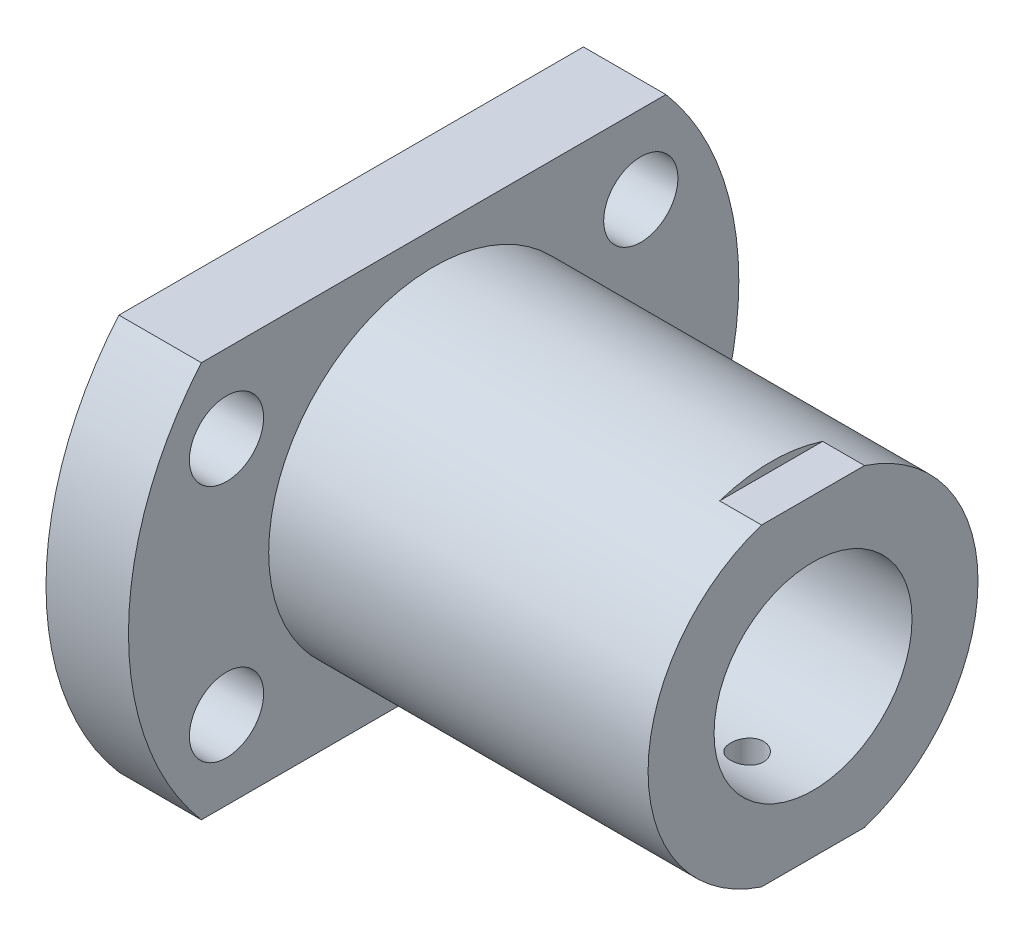
ISO-10303-21;
HEADER;
FILE_DESCRIPTION(('STEP AP214'),'2;1');
FILE_NAME('part.step','',(''),(''),'','','');
FILE_SCHEMA(('AUTOMOTIVE_DESIGN { 1 0 10303 214 1 1 1 1 }'));
ENDSEC;
DATA;
#1=APPLICATION_CONTEXT('core data for automotive mechanical design processes');
#2=APPLICATION_PROTOCOL_DEFINITION('international standard','automotive_design',2000,#1);
#3=PRODUCT_CONTEXT('',#1,'mechanical');
#4=PRODUCT('Part','Part','',(#3));
#5=PRODUCT_RELATED_PRODUCT_CATEGORY('part','',(#4));
#6=PRODUCT_DEFINITION_FORMATION('','',#4);
#7=PRODUCT_DEFINITION_CONTEXT('part definition',#1,'design');
#8=PRODUCT_DEFINITION('design','',#6,#7);
#9=PRODUCT_DEFINITION_SHAPE('','',#8);
#10=(LENGTH_UNIT() NAMED_UNIT(*) SI_UNIT(.MILLI.,.METRE.));
#11=(NAMED_UNIT(*) PLANE_ANGLE_UNIT() SI_UNIT($,.RADIAN.));
#12=(NAMED_UNIT(*) SI_UNIT($,.STERADIAN.) SOLID_ANGLE_UNIT());
#13=UNCERTAINTY_MEASURE_WITH_UNIT(LENGTH_MEASURE(1.E-05),#10,'distance_accuracy_value','');
#14=(GEOMETRIC_REPRESENTATION_CONTEXT(3) GLOBAL_UNCERTAINTY_ASSIGNED_CONTEXT((#13)) GLOBAL_UNIT_ASSIGNED_CONTEXT((#10,
#11,#12)) REPRESENTATION_CONTEXT('',''));
#15=CARTESIAN_POINT('',(0.,0.,0.));
#16=DIRECTION('',(0.,0.,1.));
#17=DIRECTION('',(1.,0.,0.));
#18=AXIS2_PLACEMENT_3D('',#15,#16,#17);
#19=CARTESIAN_POINT('',(0.,0.,0.));
#20=DIRECTION('',(1.,0.,0.));
#21=DIRECTION('',(0.,0.,-1.));
#22=AXIS2_PLACEMENT_3D('',#19,#20,#21);
#23=PLANE('',#22);
#24=DIRECTION('',(0.,0.,-1.));
#25=VECTOR('',#24,1.);
#26=CARTESIAN_POINT('',(0.,-12.,-14.0801278403287));
#27=LINE('',#26,#25);
#28=CARTESIAN_POINT('',(0.,-12.,14.0801278403287));
#29=VERTEX_POINT('',#28);
#30=CARTESIAN_POINT('',(0.,-12.,-14.0801278403287));
#31=VERTEX_POINT('',#30);
#32=EDGE_CURVE('E90',#29,#31,#27,.T.);
#33=ORIENTED_EDGE('',*,*,#32,.F.);
#34=CARTESIAN_POINT('',(0.,0.,0.));
#35=DIRECTION('',(-1.,0.,0.));
#36=DIRECTION('',(0.,0.,1.));
#37=AXIS2_PLACEMENT_3D('',#34,#35,#36);
#38=CIRCLE('',#37,18.5);
#39=CARTESIAN_POINT('',(0.,12.,14.0801278403287));
#40=VERTEX_POINT('',#39);
#41=EDGE_CURVE('E77',#40,#29,#38,.F.);
#42=ORIENTED_EDGE('',*,*,#41,.F.);
#43=DIRECTION('',(0.,0.,1.));
#44=VECTOR('',#43,1.);
#45=CARTESIAN_POINT('',(0.,12.,-14.0801278403287));
#46=LINE('',#45,#44);
#47=CARTESIAN_POINT('',(0.,12.,-14.0801278403287));
#48=VERTEX_POINT('',#47);
#49=EDGE_CURVE('E87',#48,#40,#46,.T.);
#50=ORIENTED_EDGE('',*,*,#49,.F.);
#51=CARTESIAN_POINT('',(0.,0.,0.));
#52=DIRECTION('',(-1.,0.,0.));
#53=DIRECTION('',(0.,0.,1.));
#54=AXIS2_PLACEMENT_3D('',#51,#52,#53);
#55=CIRCLE('',#54,18.5);
#56=EDGE_CURVE('E93',#31,#48,#55,.F.);
#57=ORIENTED_EDGE('',*,*,#56,.F.);
#58=EDGE_LOOP('',(#33,#42,#50,#57));
#59=FACE_BOUND('',#58,.T.);
#60=CARTESIAN_POINT('',(0.,0.,0.));
#61=DIRECTION('',(-1.,0.,0.));
#62=DIRECTION('',(0.,0.,1.));
#63=AXIS2_PLACEMENT_3D('',#60,#61,#62);
#64=CIRCLE('',#63,6.);
#65=CARTESIAN_POINT('',(0.,0.,6.));
#66=VERTEX_POINT('',#65);
#67=EDGE_CURVE('E169',#66,#66,#64,.F.);
#68=ORIENTED_EDGE('',*,*,#67,.T.);
#69=EDGE_LOOP('',(#68));
#70=FACE_BOUND('',#69,.T.);
#71=CARTESIAN_POINT('',(0.,7.25000000000001,-12.5573683548744));
#72=DIRECTION('',(-1.,0.,0.));
#73=DIRECTION('',(0.,0.,1.));
#74=AXIS2_PLACEMENT_3D('',#71,#72,#73);
#75=CIRCLE('',#74,2.25);
#76=CARTESIAN_POINT('',(0.,7.25000000000001,-10.3073683548744));
#77=VERTEX_POINT('',#76);
#78=EDGE_CURVE('E96',#77,#77,#75,.F.);
#79=ORIENTED_EDGE('',*,*,#78,.T.);
#80=EDGE_LOOP('',(#79));
#81=FACE_BOUND('',#80,.T.);
#82=CARTESIAN_POINT('',(0.,-7.25000000000002,-12.5573683548743));
#83=DIRECTION('',(-1.,0.,0.));
#84=DIRECTION('',(0.,0.,1.));
#85=AXIS2_PLACEMENT_3D('',#82,#83,#84);
#86=CIRCLE('',#85,2.25);
#87=CARTESIAN_POINT('',(0.,-7.25000000000002,-10.3073683548743));
#88=VERTEX_POINT('',#87);
#89=EDGE_CURVE('E176',#88,#88,#86,.F.);
#90=ORIENTED_EDGE('',*,*,#89,.T.);
#91=EDGE_LOOP('',(#90));
#92=FACE_BOUND('',#91,.T.);
#93=CARTESIAN_POINT('',(0.,-7.25000000000002,12.5573683548743));
#94=DIRECTION('',(-1.,0.,0.));
#95=DIRECTION('',(0.,0.,1.));
#96=AXIS2_PLACEMENT_3D('',#93,#94,#95);
#97=CIRCLE('',#96,2.25);
#98=CARTESIAN_POINT('',(0.,-7.25000000000002,14.8073683548744));
#99=VERTEX_POINT('',#98);
#100=EDGE_CURVE('E178',#99,#99,#97,.F.);
#101=ORIENTED_EDGE('',*,*,#100,.T.);
#102=EDGE_LOOP('',(#101));
#103=FACE_BOUND('',#102,.T.);
#104=CARTESIAN_POINT('',(0.,7.25000000000002,12.5573683548743));
#105=DIRECTION('',(-1.,0.,0.));
#106=DIRECTION('',(0.,0.,1.));
#107=AXIS2_PLACEMENT_3D('',#104,#105,#106);
#108=CIRCLE('',#107,2.25);
#109=CARTESIAN_POINT('',(0.,7.25000000000002,14.8073683548743));
#110=VERTEX_POINT('',#109);
#111=EDGE_CURVE('E19',#110,#110,#108,.F.);
#112=ORIENTED_EDGE('',*,*,#111,.T.);
#113=EDGE_LOOP('',(#112));
#114=FACE_BOUND('',#113,.T.);
#115=ADVANCED_FACE('F16',(#59,#70,#81,#92,#103,#114),#23,.F.);
#116=CARTESIAN_POINT('',(28.,7.25000000000002,12.5573683548743));
#117=DIRECTION('',(-1.,0.,0.));
#118=DIRECTION('',(0.,0.,1.));
#119=AXIS2_PLACEMENT_3D('',#116,#117,#118);
#120=CYLINDRICAL_SURFACE('',#119,2.25);
#121=CARTESIAN_POINT('',(5.,7.25000000000002,12.5573683548743));
#122=DIRECTION('',(-1.,0.,0.));
#123=DIRECTION('',(0.,0.,1.));
#124=AXIS2_PLACEMENT_3D('',#121,#122,#123);
#125=CIRCLE('',#124,2.25);
#126=CARTESIAN_POINT('',(5.,7.25000000000002,14.8073683548743));
#127=VERTEX_POINT('',#126);
#128=EDGE_CURVE('E384',#127,#127,#125,.F.);
#129=ORIENTED_EDGE('',*,*,#128,.T.);
#130=EDGE_LOOP('',(#129));
#131=FACE_BOUND('',#130,.T.);
#132=ORIENTED_EDGE('',*,*,#111,.F.);
#133=EDGE_LOOP('',(#132));
#134=FACE_BOUND('',#133,.T.);
#135=ADVANCED_FACE('F186',(#131,#134),#120,.F.);
#136=CARTESIAN_POINT('',(28.,-7.25000000000002,12.5573683548743));
#137=DIRECTION('',(-1.,0.,0.));
#138=DIRECTION('',(0.,0.,1.));
#139=AXIS2_PLACEMENT_3D('',#136,#137,#138);
#140=CYLINDRICAL_SURFACE('',#139,2.25);
#141=CARTESIAN_POINT('',(5.,-7.25000000000002,12.5573683548743));
#142=DIRECTION('',(-1.,0.,0.));
#143=DIRECTION('',(0.,0.,1.));
#144=AXIS2_PLACEMENT_3D('',#141,#142,#143);
#145=CIRCLE('',#144,2.25);
#146=CARTESIAN_POINT('',(5.,-7.25000000000002,14.8073683548744));
#147=VERTEX_POINT('',#146);
#148=EDGE_CURVE('E380',#147,#147,#145,.F.);
#149=ORIENTED_EDGE('',*,*,#148,.T.);
#150=EDGE_LOOP('',(#149));
#151=FACE_BOUND('',#150,.T.);
#152=ORIENTED_EDGE('',*,*,#100,.F.);
#153=EDGE_LOOP('',(#152));
#154=FACE_BOUND('',#153,.T.);
#155=ADVANCED_FACE('F188',(#151,#154),#140,.F.);
#156=CARTESIAN_POINT('',(28.,-7.25000000000002,-12.5573683548743));
#157=DIRECTION('',(-1.,0.,0.));
#158=DIRECTION('',(0.,0.,1.));
#159=AXIS2_PLACEMENT_3D('',#156,#157,#158);
#160=CYLINDRICAL_SURFACE('',#159,2.25);
#161=CARTESIAN_POINT('',(5.,-7.25000000000002,-12.5573683548743));
#162=DIRECTION('',(-1.,0.,0.));
#163=DIRECTION('',(0.,0.,1.));
#164=AXIS2_PLACEMENT_3D('',#161,#162,#163);
#165=CIRCLE('',#164,2.25);
#166=CARTESIAN_POINT('',(5.,-7.25000000000002,-10.3073683548743));
#167=VERTEX_POINT('',#166);
#168=EDGE_CURVE('E255',#167,#167,#165,.F.);
#169=ORIENTED_EDGE('',*,*,#168,.T.);
#170=EDGE_LOOP('',(#169));
#171=FACE_BOUND('',#170,.T.);
#172=ORIENTED_EDGE('',*,*,#89,.F.);
#173=EDGE_LOOP('',(#172));
#174=FACE_BOUND('',#173,.T.);
#175=ADVANCED_FACE('F195',(#171,#174),#160,.F.);
#176=CARTESIAN_POINT('',(28.,7.25000000000001,-12.5573683548744));
#177=DIRECTION('',(-1.,0.,0.));
#178=DIRECTION('',(0.,0.,1.));
#179=AXIS2_PLACEMENT_3D('',#176,#177,#178);
#180=CYLINDRICAL_SURFACE('',#179,2.25);
#181=CARTESIAN_POINT('',(5.,7.25000000000001,-12.5573683548744));
#182=DIRECTION('',(-1.,0.,0.));
#183=DIRECTION('',(0.,0.,1.));
#184=AXIS2_PLACEMENT_3D('',#181,#182,#183);
#185=CIRCLE('',#184,2.25);
#186=CARTESIAN_POINT('',(5.,7.25000000000001,-10.3073683548744));
#187=VERTEX_POINT('',#186);
#188=EDGE_CURVE('E252',#187,#187,#185,.F.);
#189=ORIENTED_EDGE('',*,*,#188,.T.);
#190=EDGE_LOOP('',(#189));
#191=FACE_BOUND('',#190,.T.);
#192=ORIENTED_EDGE('',*,*,#78,.F.);
#193=EDGE_LOOP('',(#192));
#194=FACE_BOUND('',#193,.T.);
#195=ADVANCED_FACE('F202',(#191,#194),#180,.F.);
#196=CARTESIAN_POINT('',(5.,-12.,-14.0801278403287));
#197=DIRECTION('',(0.,-1.,0.));
#198=DIRECTION('',(0.,0.,-1.));
#199=AXIS2_PLACEMENT_3D('',#196,#197,#198);
#200=PLANE('',#199);
#201=DIRECTION('',(0.,0.,1.));
#202=VECTOR('',#201,1.);
#203=CARTESIAN_POINT('',(5.,-12.,0.));
#204=LINE('',#203,#202);
#205=CARTESIAN_POINT('',(5.,-12.,-14.0801278403287));
#206=VERTEX_POINT('',#205);
#207=CARTESIAN_POINT('',(5.,-12.,14.0801278403287));
#208=VERTEX_POINT('',#207);
#209=EDGE_CURVE('E101',#206,#208,#204,.T.);
#210=ORIENTED_EDGE('',*,*,#209,.T.);
#211=DIRECTION('',(-1.,0.,0.));
#212=VECTOR('',#211,1.);
#213=CARTESIAN_POINT('',(5.,-12.,14.0801278403287));
#214=LINE('',#213,#212);
#215=EDGE_CURVE('E83',#29,#208,#214,.F.);
#216=ORIENTED_EDGE('',*,*,#215,.F.);
#217=ORIENTED_EDGE('',*,*,#32,.T.);
#218=DIRECTION('',(-1.,0.,0.));
#219=VECTOR('',#218,1.);
#220=CARTESIAN_POINT('',(5.,-12.,-14.0801278403287));
#221=LINE('',#220,#219);
#222=EDGE_CURVE('E245',#206,#31,#221,.T.);
#223=ORIENTED_EDGE('',*,*,#222,.F.);
#224=EDGE_LOOP('',(#210,#216,#217,#223));
#225=FACE_BOUND('',#224,.T.);
#226=ADVANCED_FACE('F99',(#225),#200,.T.);
#227=CARTESIAN_POINT('',(5.,0.,0.));
#228=DIRECTION('',(-1.,0.,0.));
#229=DIRECTION('',(0.,0.,1.));
#230=AXIS2_PLACEMENT_3D('',#227,#228,#229);
#231=CYLINDRICAL_SURFACE('',#230,18.5);
#232=DIRECTION('',(1.,0.,0.));
#233=VECTOR('',#232,1.);
#234=CARTESIAN_POINT('',(5.,12.,14.0801278403287));
#235=LINE('',#234,#233);
#236=CARTESIAN_POINT('',(5.,12.,14.0801278403287));
#237=VERTEX_POINT('',#236);
#238=EDGE_CURVE('E85',#40,#237,#235,.T.);
#239=ORIENTED_EDGE('',*,*,#238,.F.);
#240=ORIENTED_EDGE('',*,*,#41,.T.);
#241=ORIENTED_EDGE('',*,*,#215,.T.);
#242=CARTESIAN_POINT('',(5.,0.,0.));
#243=DIRECTION('',(-1.,0.,0.));
#244=DIRECTION('',(0.,0.,1.));
#245=AXIS2_PLACEMENT_3D('',#242,#243,#244);
#246=CIRCLE('',#245,18.5);
#247=EDGE_CURVE('E251',#208,#237,#246,.T.);
#248=ORIENTED_EDGE('',*,*,#247,.T.);
#249=EDGE_LOOP('',(#239,#240,#241,#248));
#250=FACE_BOUND('',#249,.T.);
#251=ADVANCED_FACE('F81',(#250),#231,.T.);
#252=CARTESIAN_POINT('',(5.,12.,-14.0801278403287));
#253=DIRECTION('',(0.,1.,0.));
#254=DIRECTION('',(0.,0.,1.));
#255=AXIS2_PLACEMENT_3D('',#252,#253,#254);
#256=PLANE('',#255);
#257=DIRECTION('',(0.,0.,1.));
#258=VECTOR('',#257,1.);
#259=CARTESIAN_POINT('',(5.,12.,0.));
#260=LINE('',#259,#258);
#261=CARTESIAN_POINT('',(5.,12.,-14.0801278403287));
#262=VERTEX_POINT('',#261);
#263=EDGE_CURVE('E240',#237,#262,#260,.F.);
#264=ORIENTED_EDGE('',*,*,#263,.T.);
#265=DIRECTION('',(-1.,0.,0.));
#266=VECTOR('',#265,1.);
#267=CARTESIAN_POINT('',(5.,12.,-14.0801278403287));
#268=LINE('',#267,#266);
#269=EDGE_CURVE('E172',#48,#262,#268,.F.);
#270=ORIENTED_EDGE('',*,*,#269,.F.);
#271=ORIENTED_EDGE('',*,*,#49,.T.);
#272=ORIENTED_EDGE('',*,*,#238,.T.);
#273=EDGE_LOOP('',(#264,#270,#271,#272));
#274=FACE_BOUND('',#273,.T.);
#275=ADVANCED_FACE('F211',(#274),#256,.T.);
#276=CARTESIAN_POINT('',(5.,0.,0.));
#277=DIRECTION('',(-1.,0.,0.));
#278=DIRECTION('',(0.,0.,1.));
#279=AXIS2_PLACEMENT_3D('',#276,#277,#278);
#280=CYLINDRICAL_SURFACE('',#279,18.5);
#281=CARTESIAN_POINT('',(5.,0.,0.));
#282=DIRECTION('',(-1.,0.,0.));
#283=DIRECTION('',(0.,0.,1.));
#284=AXIS2_PLACEMENT_3D('',#281,#282,#283);
#285=CIRCLE('',#284,18.5);
#286=EDGE_CURVE('E237',#262,#206,#285,.T.);
#287=ORIENTED_EDGE('',*,*,#286,.T.);
#288=ORIENTED_EDGE('',*,*,#222,.T.);
#289=ORIENTED_EDGE('',*,*,#56,.T.);
#290=ORIENTED_EDGE('',*,*,#269,.T.);
#291=EDGE_LOOP('',(#287,#288,#289,#290));
#292=FACE_BOUND('',#291,.T.);
#293=ADVANCED_FACE('F214',(#292),#280,.T.);
#294=CARTESIAN_POINT('',(25.46,-9.5,-18.5));
#295=DIRECTION('',(-1.,0.,0.));
#296=DIRECTION('',(0.,-1.,0.));
#297=AXIS2_PLACEMENT_3D('',#294,#295,#296);
#298=PLANE('',#297);
#299=CARTESIAN_POINT('',(25.46,0.,0.));
#300=DIRECTION('',(-1.,0.,0.));
#301=DIRECTION('',(0.,0.,1.));
#302=AXIS2_PLACEMENT_3D('',#299,#300,#301);
#303=CIRCLE('',#302,10.);
#304=CARTESIAN_POINT('',(25.46,-9.5,-3.12249899919921));
#305=VERTEX_POINT('',#304);
#306=CARTESIAN_POINT('',(25.46,-9.5,3.1224989991992));
#307=VERTEX_POINT('',#306);
#308=EDGE_CURVE('E131',#305,#307,#303,.T.);
#309=ORIENTED_EDGE('',*,*,#308,.F.);
#310=DIRECTION('',(0.,0.,1.));
#311=VECTOR('',#310,1.);
#312=CARTESIAN_POINT('',(25.46,-9.5,-18.5));
#313=LINE('',#312,#311);
#314=EDGE_CURVE('E170',#305,#307,#313,.T.);
#315=ORIENTED_EDGE('',*,*,#314,.T.);
#316=EDGE_LOOP('',(#309,#315));
#317=FACE_BOUND('',#316,.T.);
#318=ADVANCED_FACE('F217',(#317),#298,.F.);
#319=CARTESIAN_POINT('',(24.,-12.,0.));
#320=DIRECTION('',(0.,1.,0.));
#321=DIRECTION('',(0.,0.,1.));
#322=AXIS2_PLACEMENT_3D('',#319,#320,#321);
#323=CYLINDRICAL_SURFACE('',#322,0.999999999999998);
#324=CARTESIAN_POINT('',(24.,-5.91607978309962,0.999999999999998));
#325=CARTESIAN_POINT('',(24.0556957397448,-5.91608089760083,0.999997430362736));
#326=CARTESIAN_POINT('',(24.111462585772,-5.91687549623227,0.995327225125144));
#327=CARTESIAN_POINT('',(24.2214733672251,-5.91996725428782,0.976766506224319));
#328=CARTESIAN_POINT('',(24.2757139738488,-5.92226746704964,0.962857255219504));
#329=CARTESIAN_POINT('',(24.3810020750206,-5.92810282103682,0.926249422813517));
#330=CARTESIAN_POINT('',(24.4320535063324,-5.93163640278117,0.903561936766004));
#331=CARTESIAN_POINT('',(24.5296048620222,-5.9395382156152,0.850066639095232));
#332=CARTESIAN_POINT('',(24.5761064650155,-5.94390613711394,0.819261837886824));
#333=CARTESIAN_POINT('',(24.663723871425,-5.95303376602086,0.750075912978846));
#334=CARTESIAN_POINT('',(24.7047878920607,-5.95779662271406,0.711629612614948));
#335=CARTESIAN_POINT('',(24.7799155928021,-5.9671496849089,0.628391119356938));
#336=CARTESIAN_POINT('',(24.8139784963782,-5.9717398712127,0.583598223459331));
#337=CARTESIAN_POINT('',(24.8743259504081,-5.98026296666789,0.488608939901646));
#338=CARTESIAN_POINT('',(24.9005630285583,-5.98419180380442,0.438381996059988));
#339=CARTESIAN_POINT('',(24.9442085816065,-5.99091497211554,0.334157780528416));
#340=CARTESIAN_POINT('',(24.9616177068692,-5.99370938686122,0.280160786915633));
#341=CARTESIAN_POINT('',(24.9869570028593,-5.99782693717048,0.170457536268949));
#342=CARTESIAN_POINT('',(24.9949731532148,-5.99916341023759,0.114771647626945));
#343=CARTESIAN_POINT('',(25.0015663038603,-6.00026031774893,0.00283020778882272));
#344=CARTESIAN_POINT('',(25.000143930067,-6.00002085670142,-0.0534253053855523));
#345=CARTESIAN_POINT('',(24.9879674852323,-5.99800343784229,-0.164320648453425));
#346=CARTESIAN_POINT('',(24.9773060259492,-5.99624074921798,-0.218970964751015));
#347=CARTESIAN_POINT('',(24.9470997266195,-5.99139194038926,-0.325696364455005));
#348=CARTESIAN_POINT('',(24.9275545434525,-5.98830576906758,-0.377771348306927));
#349=CARTESIAN_POINT('',(24.8800428392956,-5.98113065499251,-0.478144400660145));
#350=CARTESIAN_POINT('',(24.8520378864421,-5.97703715210988,-0.526423938030248));
#351=CARTESIAN_POINT('',(24.7884320570964,-5.96830259348044,-0.617629541642158));
#352=CARTESIAN_POINT('',(24.7528311514854,-5.96366153563462,-0.660555587360561));
#353=CARTESIAN_POINT('',(24.6745373682105,-5.95428211061504,-0.740379653882565));
#354=CARTESIAN_POINT('',(24.6317648343995,-5.9495432433298,-0.777199520036934));
#355=CARTESIAN_POINT('',(24.5405857257885,-5.9405537217856,-0.84316900713159));
#356=CARTESIAN_POINT('',(24.4921766297695,-5.93630328770353,-0.872315176491827));
#357=CARTESIAN_POINT('',(24.3909947392696,-5.92877116046283,-0.922122995219524));
#358=CARTESIAN_POINT('',(24.3382137479271,-5.92549134225201,-0.942768253004033));
#359=CARTESIAN_POINT('',(24.2299355600204,-5.92030089070035,-0.974836086298936));
#360=CARTESIAN_POINT('',(24.1744443666015,-5.91838736593836,-0.986278144632044));
#361=CARTESIAN_POINT('',(24.0987926780435,-5.91687159118963,-0.99530574898543));
#362=CARTESIAN_POINT('',(24.0790789007515,-5.91657531838753,-0.99706467292526));
#363=CARTESIAN_POINT('',(24.0395797428412,-5.91617921619692,-0.999412255641839));
#364=CARTESIAN_POINT('',(24.0197943621517,-5.91607938700397,-1.00000091325352));
#365=CARTESIAN_POINT('',(23.9443042602552,-5.91608089760085,-0.999997430362737));
#366=CARTESIAN_POINT('',(23.888537414228,-5.91687549623227,-0.995327225125145));
#367=CARTESIAN_POINT('',(23.7785266327749,-5.91996725428781,-0.976766506224319));
#368=CARTESIAN_POINT('',(23.7242860261512,-5.92226746704963,-0.962857255219503));
#369=CARTESIAN_POINT('',(23.6189979249794,-5.92810282103682,-0.926249422813517));
#370=CARTESIAN_POINT('',(23.5679464936676,-5.93163640278117,-0.903561936766004));
#371=CARTESIAN_POINT('',(23.4703951379778,-5.9395382156152,-0.850066639095232));
#372=CARTESIAN_POINT('',(23.4238935349845,-5.94390613711394,-0.819261837886824));
#373=CARTESIAN_POINT('',(23.336276128575,-5.95303376602086,-0.750075912978846));
#374=CARTESIAN_POINT('',(23.2952121079393,-5.95779662271406,-0.711629612614948));
#375=CARTESIAN_POINT('',(23.2200844071979,-5.9671496849089,-0.628391119356938));
#376=CARTESIAN_POINT('',(23.1860215036218,-5.9717398712127,-0.583598223459332));
#377=CARTESIAN_POINT('',(23.1256740495919,-5.98026296666789,-0.488608939901646));
#378=CARTESIAN_POINT('',(23.0994369714417,-5.98419180380442,-0.438381996059987));
#379=CARTESIAN_POINT('',(23.0557914183935,-5.99091497211554,-0.334157780528415));
#380=CARTESIAN_POINT('',(23.0383822931308,-5.99370938686122,-0.280160786915632));
#381=CARTESIAN_POINT('',(23.0130429971407,-5.99782693717048,-0.170457536268949));
#382=CARTESIAN_POINT('',(23.0050268467852,-5.99916341023759,-0.114771647626945));
#383=CARTESIAN_POINT('',(22.9984336961397,-6.00026031774893,-0.00283020778882227));
#384=CARTESIAN_POINT('',(22.999856069933,-6.00002085670142,0.0534253053855525));
#385=CARTESIAN_POINT('',(23.0120325147677,-5.99800343784229,0.164320648453425));
#386=CARTESIAN_POINT('',(23.0226939740508,-5.99624074921798,0.218970964751014));
#387=CARTESIAN_POINT('',(23.0529002733805,-5.99139194038926,0.325696364455005));
#388=CARTESIAN_POINT('',(23.0724454565475,-5.98830576906758,0.377771348306927));
#389=CARTESIAN_POINT('',(23.1199571607044,-5.98113065499251,0.478144400660145));
#390=CARTESIAN_POINT('',(23.1479621135579,-5.97703715210988,0.526423938030248));
#391=CARTESIAN_POINT('',(23.2115679429036,-5.96830259348044,0.617629541642158));
#392=CARTESIAN_POINT('',(23.2471688485146,-5.96366153563462,0.66055558736056));
#393=CARTESIAN_POINT('',(23.3254626317895,-5.95428211061504,0.740379653882565));
#394=CARTESIAN_POINT('',(23.3682351656005,-5.9495432433298,0.777199520036934));
#395=CARTESIAN_POINT('',(23.4594142742115,-5.9405537217856,0.84316900713159));
#396=CARTESIAN_POINT('',(23.5078233702305,-5.93630328770353,0.872315176491827));
#397=CARTESIAN_POINT('',(23.6090052607304,-5.92877116046283,0.922122995219525));
#398=CARTESIAN_POINT('',(23.6617862520729,-5.92549134225201,0.942768253004034));
#399=CARTESIAN_POINT('',(23.7700644399796,-5.92030089070035,0.974836086298937));
#400=CARTESIAN_POINT('',(23.8255556333985,-5.91838736593835,0.986278144632044));
#401=CARTESIAN_POINT('',(23.9012073219565,-5.91687159118963,0.99530574898543));
#402=CARTESIAN_POINT('',(23.9209210992485,-5.91657531838754,0.99706467292526));
#403=CARTESIAN_POINT('',(23.9604202571588,-5.91617921619692,0.999412255641839));
#404=CARTESIAN_POINT('',(23.9802056378483,-5.91607938700396,1.00000091325352));
#405=CARTESIAN_POINT('',(24.,-5.91607978309962,0.999999999999998));
#406=B_SPLINE_CURVE_WITH_KNOTS('',3,(#324,#325,#326,#327,#328,#329,#330,#331,#332,#333,#334,
#335,#336,#337,#338,#339,#340,#341,#342,#343,#344,#345,#346,#347,#348,#349,#350,#351,#352,#353,
#354,#355,#356,#357,#358,#359,#360,#361,#362,#363,#364,#365,#366,#367,#368,#369,#370,#371,#372,
#373,#374,#375,#376,#377,#378,#379,#380,#381,#382,#383,#384,#385,#386,#387,#388,#389,#390,#391,
#392,#393,#394,#395,#396,#397,#398,#399,#400,#401,#402,#403,#404,#405),.UNSPECIFIED.,.T.,.F.,(4,
2,2,2,2,2,2,2,2,2,2,2,2,2,2,2,2,2,2,2,2,2,2,2,2,2,2,2,2,2,2,2,2,2,2,2,2,2,2,2,4),(0.,
0.167011630447707,0.334363008938283,0.501503549060948,0.668582189907185,0.837152287302727,
1.00574107159065,1.17533265406039,1.34491174072134,1.51292613069496,1.68092937888666,
1.84726780553137,2.01361265729293,2.18072486086639,2.34783770506956,2.51694730622927,
2.68613284236423,2.85564309389017,3.02479354716663,3.08414971014389,3.14350593221353,
3.31051756266124,3.47786894115182,3.64500948127448,3.81208812212072,3.98065821951626,
4.14924700380418,4.31883858627392,4.48841767293487,4.6564320629085,4.82443531110019,
4.99077373774491,5.15711858950646,5.32423079307992,5.4913436372831,5.6604532384428,
5.82963877457777,5.9991490261037,6.16829947938017,6.22765564235743,6.28701186442707),.UNSPECIFIED.);
#407=CARTESIAN_POINT('',(24.,-5.91607978309962,0.999999999999998));
#408=VERTEX_POINT('',#407);
#409=EDGE_CURVE('E163',#408,#408,#406,.T.);
#410=ORIENTED_EDGE('',*,*,#409,.T.);
#411=EDGE_LOOP('',(#410));
#412=FACE_BOUND('',#411,.T.);
#413=CARTESIAN_POINT('',(24.0000000000002,-9.9498743710662,-0.999999999999998));
#414=CARTESIAN_POINT('',(23.9440143824036,-9.94987541116602,-0.999995487044237));
#415=CARTESIAN_POINT('',(23.8879816523878,-9.95035218509344,-0.995281068962152));
#416=CARTESIAN_POINT('',(23.7774178898694,-9.95220939516237,-0.976530932220181));
#417=CARTESIAN_POINT('',(23.722890264858,-9.95359173043279,-0.962475623092603));
#418=CARTESIAN_POINT('',(23.6170282681463,-9.95710156588807,-0.925457761180735));
#419=CARTESIAN_POINT('',(23.5656908001442,-9.95922832981091,-0.902504006819697));
#420=CARTESIAN_POINT('',(23.467620980052,-9.96398642377636,-0.848356891592336));
#421=CARTESIAN_POINT('',(23.4208866318968,-9.96661753364665,-0.817167123924152));
#422=CARTESIAN_POINT('',(23.3331498477305,-9.97209920165961,-0.74730561120681));
#423=CARTESIAN_POINT('',(23.2921670052553,-9.97495046098913,-0.708609311434814));
#424=CARTESIAN_POINT('',(23.217264042001,-9.98054491761493,-0.624883919580161));
#425=CARTESIAN_POINT('',(23.1833445891061,-9.98328810467248,-0.579854229312739));
#426=CARTESIAN_POINT('',(23.1234686128998,-9.98836384290785,-0.484626150976342));
#427=CARTESIAN_POINT('',(23.0975287744923,-9.99069552938326,-0.434417222039378));
#428=CARTESIAN_POINT('',(23.0544554162661,-9.99467818320868,-0.330329513034761));
#429=CARTESIAN_POINT('',(23.0373216049423,-9.99632917309136,-0.276450854512712));
#430=CARTESIAN_POINT('',(23.0124021018674,-9.99875966462905,-0.166744831538025));
#431=CARTESIAN_POINT('',(23.004585180925,-9.99954207705163,-0.110924626245308));
#432=CARTESIAN_POINT('',(22.9984247281265,-10.0001571562716,0.00124064081207929));
#433=CARTESIAN_POINT('',(23.0000809673991,-9.9999898460142,0.0575856898636982));
#434=CARTESIAN_POINT('',(23.0127944430196,-9.99872671597691,0.168988591051384));
#435=CARTESIAN_POINT('',(23.0238180123982,-9.99763422143475,0.224050328288993));
#436=CARTESIAN_POINT('',(23.0549009483937,-9.99464730999639,0.331538700026734));
#437=CARTESIAN_POINT('',(23.0749605145647,-9.9927528753899,0.383965276302607));
#438=CARTESIAN_POINT('',(23.1235837600771,-9.98836928375468,0.484802402633364));
#439=CARTESIAN_POINT('',(23.1521626272465,-9.98587906616928,0.53320558119521));
#440=CARTESIAN_POINT('',(23.216999568827,-9.9805836136559,0.624537074702208));
#441=CARTESIAN_POINT('',(23.2532572340215,-9.97777839551861,0.667465681201588));
#442=CARTESIAN_POINT('',(23.3326049022721,-9.97215358179341,0.74682359550679));
#443=CARTESIAN_POINT('',(23.3757228706156,-9.96933397517684,0.783224944555354));
#444=CARTESIAN_POINT('',(23.4674948721236,-9.96400857429251,0.848294227667594));
#445=CARTESIAN_POINT('',(23.5161514573557,-9.96150292581564,0.876958576023993));
#446=CARTESIAN_POINT('',(23.6176584994678,-9.95708852009593,0.925737964187005));
#447=CARTESIAN_POINT('',(23.6705132317065,-9.95518038138156,0.945844152464097));
#448=CARTESIAN_POINT('',(23.7787850994923,-9.95218690590292,0.976843473662424));
#449=CARTESIAN_POINT('',(23.8341965331201,-9.95109982399909,0.98775615293496));
#450=CARTESIAN_POINT('',(23.9265821166601,-9.95007764862546,0.997979904737807));
#451=CARTESIAN_POINT('',(23.9632809253796,-9.94987368889988,1.00000295989518));
#452=CARTESIAN_POINT('',(24.0559856175966,-9.94987541116602,0.999995487044227));
#453=CARTESIAN_POINT('',(24.1120183476124,-9.95035218509344,0.995281068962131));
#454=CARTESIAN_POINT('',(24.2225821101308,-9.95220939516238,0.97653093222014));
#455=CARTESIAN_POINT('',(24.2771097351421,-9.95359173043279,0.962475623092552));
#456=CARTESIAN_POINT('',(24.3829717318539,-9.95710156588808,0.925457761180665));
#457=CARTESIAN_POINT('',(24.434309199856,-9.95922832981092,0.902504006819617));
#458=CARTESIAN_POINT('',(24.5323790199481,-9.96398642377637,0.848356891592238));
#459=CARTESIAN_POINT('',(24.5791133681033,-9.96661753364666,0.817167123924045));
#460=CARTESIAN_POINT('',(24.6668501522697,-9.97209920165962,0.747305611206686));
#461=CARTESIAN_POINT('',(24.7078329947448,-9.97495046098914,0.708609311434682));
#462=CARTESIAN_POINT('',(24.7827359579991,-9.98054491761494,0.624883919580016));
#463=CARTESIAN_POINT('',(24.816655410894,-9.98328810467249,0.579854229312589));
#464=CARTESIAN_POINT('',(24.8765313871003,-9.98836384290786,0.484626150976182));
#465=CARTESIAN_POINT('',(24.9024712255078,-9.99069552938327,0.434417222039213));
#466=CARTESIAN_POINT('',(24.9455445837339,-9.99467818320868,0.330329513034588));
#467=CARTESIAN_POINT('',(24.9626783950577,-9.99632917309137,0.276450854512535));
#468=CARTESIAN_POINT('',(24.9875978981327,-9.99875966462905,0.166744831537843));
#469=CARTESIAN_POINT('',(24.995414819075,-9.99954207705163,0.110924626245124));
#470=CARTESIAN_POINT('',(25.0015752718735,-10.0001571562716,-0.00124064081226414));
#471=CARTESIAN_POINT('',(24.9999190326009,-9.9999898460142,-0.0575856898638826));
#472=CARTESIAN_POINT('',(24.9872055569804,-9.9987267159769,-0.168988591051567));
#473=CARTESIAN_POINT('',(24.9761819876018,-9.99763422143475,-0.224050328289174));
#474=CARTESIAN_POINT('',(24.9450990516063,-9.99464730999638,-0.33153870002691));
#475=CARTESIAN_POINT('',(24.9250394854352,-9.9927528753899,-0.383965276302778));
#476=CARTESIAN_POINT('',(24.8764162399228,-9.98836928375467,-0.484802402633525));
#477=CARTESIAN_POINT('',(24.8478373727534,-9.98587906616927,-0.533205581195365));
#478=CARTESIAN_POINT('',(24.7830004311729,-9.9805836136559,-0.624537074702352));
#479=CARTESIAN_POINT('',(24.7467427659784,-9.9777783955186,-0.667465681201725));
#480=CARTESIAN_POINT('',(24.6673950977278,-9.97215358179341,-0.746823595506912));
#481=CARTESIAN_POINT('',(24.6242771293843,-9.96933397517683,-0.783224944555467));
#482=CARTESIAN_POINT('',(24.5325051278763,-9.9640085742925,-0.848294227667691));
#483=CARTESIAN_POINT('',(24.4838485426442,-9.96150292581564,-0.876958576024082));
#484=CARTESIAN_POINT('',(24.3823415005321,-9.95708852009592,-0.925737964187076));
#485=CARTESIAN_POINT('',(24.3294867682933,-9.95518038138155,-0.945844152464158));
#486=CARTESIAN_POINT('',(24.2212149005075,-9.95218690590291,-0.976843473662466));
#487=CARTESIAN_POINT('',(24.1658034668797,-9.95109982399908,-0.987756152934991));
#488=CARTESIAN_POINT('',(24.0734178833398,-9.95007764862546,-0.997979904737807));
#489=CARTESIAN_POINT('',(24.0367190746204,-9.94987368889988,-1.00000295989517));
#490=CARTESIAN_POINT('',(24.0000000000002,-9.9498743710662,-0.999999999999998));
#491=B_SPLINE_CURVE_WITH_KNOTS('',3,(#413,#414,#415,#416,#417,#418,#419,#420,#421,#422,#423,
#424,#425,#426,#427,#428,#429,#430,#431,#432,#433,#434,#435,#436,#437,#438,#439,#440,#441,#442,
#443,#444,#445,#446,#447,#448,#449,#450,#451,#452,#453,#454,#455,#456,#457,#458,#459,#460,#461,
#462,#463,#464,#465,#466,#467,#468,#469,#470,#471,#472,#473,#474,#475,#476,#477,#478,#479,#480,
#481,#482,#483,#484,#485,#486,#487,#488,#489,#490),.UNSPECIFIED.,.T.,.F.,(4,2,2,2,2,2,2,2,2,2,2,
2,2,2,2,2,2,2,2,2,2,2,2,2,2,2,2,2,2,2,2,2,2,2,2,2,2,2,4),(0.,0.167840014169936,
0.336033151479989,0.504060408633106,0.672014479823637,0.840527505557248,1.00905645794191,
1.17793543608176,1.34680882347593,1.51511455955108,1.68341622937995,1.85111555494092,
2.01881858421528,2.18682239335913,2.35481725153956,2.52351534776468,2.6922914932784,
2.86124177881491,3.02983194548323,3.13991253884194,3.30775255301188,3.47594569032193,
3.64397294747505,3.81192701866558,3.98044004439919,4.14896899678385,4.3178479749237,
4.48672136231787,4.65502709839303,4.82332876822189,4.99102809378286,5.15873112305722,
5.32673493220107,5.4947297903815,5.66342788660662,5.83220403212034,6.00115431765685,
6.16974448432518,6.27982507768352),.UNSPECIFIED.);
#492=CARTESIAN_POINT('',(24.0000000000002,-9.9498743710662,-0.999999999999998));
#493=VERTEX_POINT('',#492);
#494=EDGE_CURVE('E123',#493,#493,#491,.T.);
#495=ORIENTED_EDGE('',*,*,#494,.F.);
#496=EDGE_LOOP('',(#495));
#497=FACE_BOUND('',#496,.T.);
#498=ADVANCED_FACE('F133',(#412,#497),#323,.F.);
#499=CARTESIAN_POINT('',(25.46,-9.5,-18.5));
#500=DIRECTION('',(0.,1.,0.));
#501=DIRECTION('',(-1.,0.,0.));
#502=AXIS2_PLACEMENT_3D('',#499,#500,#501);
#503=PLANE('',#502);
#504=DIRECTION('',(-1.,0.,0.));
#505=VECTOR('',#504,1.);
#506=CARTESIAN_POINT('',(28.,-9.5,3.1224989991992));
#507=LINE('',#506,#505);
#508=CARTESIAN_POINT('',(28.,-9.5,3.1224989991992));
#509=VERTEX_POINT('',#508);
#510=EDGE_CURVE('E130',#307,#509,#507,.F.);
#511=ORIENTED_EDGE('',*,*,#510,.F.);
#512=ORIENTED_EDGE('',*,*,#314,.F.);
#513=DIRECTION('',(-1.,0.,0.));
#514=VECTOR('',#513,1.);
#515=CARTESIAN_POINT('',(28.,-9.5,-3.1224989991992));
#516=LINE('',#515,#514);
#517=CARTESIAN_POINT('',(28.,-9.5,-3.1224989991992));
#518=VERTEX_POINT('',#517);
#519=EDGE_CURVE('E231',#518,#305,#516,.T.);
#520=ORIENTED_EDGE('',*,*,#519,.F.);
#521=DIRECTION('',(0.,0.,-1.));
#522=VECTOR('',#521,1.);
#523=CARTESIAN_POINT('',(28.,-9.5,0.));
#524=LINE('',#523,#522);
#525=EDGE_CURVE('E122',#509,#518,#524,.T.);
#526=ORIENTED_EDGE('',*,*,#525,.F.);
#527=EDGE_LOOP('',(#511,#512,#520,#526));
#528=FACE_BOUND('',#527,.T.);
#529=ADVANCED_FACE('F160',(#528),#503,.F.);
#530=CARTESIAN_POINT('',(28.,0.,0.));
#531=DIRECTION('',(-1.,0.,0.));
#532=DIRECTION('',(0.,0.,1.));
#533=AXIS2_PLACEMENT_3D('',#530,#531,#532);
#534=CYLINDRICAL_SURFACE('',#533,6.);
#535=CARTESIAN_POINT('',(28.,0.,0.));
#536=DIRECTION('',(-1.,0.,0.));
#537=DIRECTION('',(0.,0.,1.));
#538=AXIS2_PLACEMENT_3D('',#535,#536,#537);
#539=CIRCLE('',#538,6.);
#540=CARTESIAN_POINT('',(28.,0.,6.));
#541=VERTEX_POINT('',#540);
#542=EDGE_CURVE('E119',#541,#541,#539,.T.);
#543=ORIENTED_EDGE('',*,*,#542,.F.);
#544=EDGE_LOOP('',(#543));
#545=FACE_BOUND('',#544,.T.);
#546=ORIENTED_EDGE('',*,*,#67,.F.);
#547=EDGE_LOOP('',(#546));
#548=FACE_BOUND('',#547,.T.);
#549=ORIENTED_EDGE('',*,*,#409,.F.);
#550=EDGE_LOOP('',(#549));
#551=FACE_BOUND('',#550,.T.);
#552=ADVANCED_FACE('F156',(#545,#548,#551),#534,.F.);
#553=CARTESIAN_POINT('',(5.,0.,0.));
#554=DIRECTION('',(-1.,0.,0.));
#555=DIRECTION('',(0.,0.,1.));
#556=AXIS2_PLACEMENT_3D('',#553,#554,#555);
#557=PLANE('',#556);
#558=ORIENTED_EDGE('',*,*,#263,.F.);
#559=ORIENTED_EDGE('',*,*,#247,.F.);
#560=ORIENTED_EDGE('',*,*,#209,.F.);
#561=ORIENTED_EDGE('',*,*,#286,.F.);
#562=EDGE_LOOP('',(#558,#559,#560,#561));
#563=FACE_BOUND('',#562,.T.);
#564=CARTESIAN_POINT('',(5.,0.,0.));
#565=DIRECTION('',(-1.,0.,0.));
#566=DIRECTION('',(0.,0.,1.));
#567=AXIS2_PLACEMENT_3D('',#564,#565,#566);
#568=CIRCLE('',#567,10.);
#569=CARTESIAN_POINT('',(5.,0.,10.));
#570=VERTEX_POINT('',#569);
#571=EDGE_CURVE('E113',#570,#570,#568,.F.);
#572=ORIENTED_EDGE('',*,*,#571,.F.);
#573=EDGE_LOOP('',(#572));
#574=FACE_BOUND('',#573,.T.);
#575=ORIENTED_EDGE('',*,*,#188,.F.);
#576=EDGE_LOOP('',(#575));
#577=FACE_BOUND('',#576,.T.);
#578=ORIENTED_EDGE('',*,*,#168,.F.);
#579=EDGE_LOOP('',(#578));
#580=FACE_BOUND('',#579,.T.);
#581=ORIENTED_EDGE('',*,*,#148,.F.);
#582=EDGE_LOOP('',(#581));
#583=FACE_BOUND('',#582,.T.);
#584=ORIENTED_EDGE('',*,*,#128,.F.);
#585=EDGE_LOOP('',(#584));
#586=FACE_BOUND('',#585,.T.);
#587=ADVANCED_FACE('F152',(#563,#574,#577,#580,#583,#586),#557,.F.);
#588=CARTESIAN_POINT('',(28.,0.,0.));
#589=DIRECTION('',(1.,0.,0.));
#590=DIRECTION('',(0.,0.,-1.));
#591=AXIS2_PLACEMENT_3D('',#588,#589,#590);
#592=PLANE('',#591);
#593=ORIENTED_EDGE('',*,*,#542,.T.);
#594=EDGE_LOOP('',(#593));
#595=FACE_BOUND('',#594,.T.);
#596=CARTESIAN_POINT('',(28.,0.,0.));
#597=DIRECTION('',(-1.,0.,0.));
#598=DIRECTION('',(0.,0.,1.));
#599=AXIS2_PLACEMENT_3D('',#596,#597,#598);
#600=CIRCLE('',#599,10.);
#601=CARTESIAN_POINT('',(28.,9.5,3.1224989991992));
#602=VERTEX_POINT('',#601);
#603=EDGE_CURVE('E110',#509,#602,#600,.T.);
#604=ORIENTED_EDGE('',*,*,#603,.F.);
#605=ORIENTED_EDGE('',*,*,#525,.T.);
#606=CARTESIAN_POINT('',(28.,0.,0.));
#607=DIRECTION('',(-1.,0.,0.));
#608=DIRECTION('',(0.,0.,1.));
#609=AXIS2_PLACEMENT_3D('',#606,#607,#608);
#610=CIRCLE('',#609,10.);
#611=CARTESIAN_POINT('',(28.,9.5,-3.1224989991992));
#612=VERTEX_POINT('',#611);
#613=EDGE_CURVE('E116',#612,#518,#610,.T.);
#614=ORIENTED_EDGE('',*,*,#613,.F.);
#615=DIRECTION('',(0.,0.,1.));
#616=VECTOR('',#615,1.);
#617=CARTESIAN_POINT('',(28.,9.5,-18.5));
#618=LINE('',#617,#616);
#619=EDGE_CURVE('E118',#612,#602,#618,.T.);
#620=ORIENTED_EDGE('',*,*,#619,.T.);
#621=EDGE_LOOP('',(#604,#605,#614,#620));
#622=FACE_BOUND('',#621,.T.);
#623=ADVANCED_FACE('F149',(#595,#622),#592,.T.);
#624=CARTESIAN_POINT('',(25.46,51.8319736668733,-18.5));
#625=DIRECTION('',(-1.,0.,0.));
#626=DIRECTION('',(0.,-1.,0.));
#627=AXIS2_PLACEMENT_3D('',#624,#625,#626);
#628=PLANE('',#627);
#629=CARTESIAN_POINT('',(25.46,0.,0.));
#630=DIRECTION('',(-1.,0.,0.));
#631=DIRECTION('',(0.,0.,1.));
#632=AXIS2_PLACEMENT_3D('',#629,#630,#631);
#633=CIRCLE('',#632,10.);
#634=CARTESIAN_POINT('',(25.46,9.5,3.1224989991992));
#635=VERTEX_POINT('',#634);
#636=CARTESIAN_POINT('',(25.46,9.5,-3.1224989991992));
#637=VERTEX_POINT('',#636);
#638=EDGE_CURVE('E25',#635,#637,#633,.T.);
#639=ORIENTED_EDGE('',*,*,#638,.F.);
#640=DIRECTION('',(0.,0.,1.));
#641=VECTOR('',#640,1.);
#642=CARTESIAN_POINT('',(25.46,9.5,-18.5));
#643=LINE('',#642,#641);
#644=EDGE_CURVE('E33',#635,#637,#643,.F.);
#645=ORIENTED_EDGE('',*,*,#644,.T.);
#646=EDGE_LOOP('',(#639,#645));
#647=FACE_BOUND('',#646,.T.);
#648=ADVANCED_FACE('F145',(#647),#628,.F.);
#649=CARTESIAN_POINT('',(25.46,9.5,-18.5));
#650=DIRECTION('',(0.,-1.,0.));
#651=DIRECTION('',(1.,0.,0.));
#652=AXIS2_PLACEMENT_3D('',#649,#650,#651);
#653=PLANE('',#652);
#654=DIRECTION('',(-1.,0.,0.));
#655=VECTOR('',#654,1.);
#656=CARTESIAN_POINT('',(28.,9.5,-3.1224989991992));
#657=LINE('',#656,#655);
#658=EDGE_CURVE('E11',#637,#612,#657,.F.);
#659=ORIENTED_EDGE('',*,*,#658,.F.);
#660=ORIENTED_EDGE('',*,*,#644,.F.);
#661=DIRECTION('',(-1.,0.,0.));
#662=VECTOR('',#661,1.);
#663=CARTESIAN_POINT('',(28.,9.5,3.1224989991992));
#664=LINE('',#663,#662);
#665=EDGE_CURVE('E109',#602,#635,#664,.T.);
#666=ORIENTED_EDGE('',*,*,#665,.F.);
#667=ORIENTED_EDGE('',*,*,#619,.F.);
#668=EDGE_LOOP('',(#659,#660,#666,#667));
#669=FACE_BOUND('',#668,.T.);
#670=ADVANCED_FACE('F141',(#669),#653,.F.);
#671=CARTESIAN_POINT('',(28.,0.,0.));
#672=DIRECTION('',(-1.,0.,0.));
#673=DIRECTION('',(0.,0.,1.));
#674=AXIS2_PLACEMENT_3D('',#671,#672,#673);
#675=CYLINDRICAL_SURFACE('',#674,10.);
#676=ORIENTED_EDGE('',*,*,#571,.T.);
#677=EDGE_LOOP('',(#676));
#678=FACE_BOUND('',#677,.T.);
#679=ORIENTED_EDGE('',*,*,#638,.T.);
#680=ORIENTED_EDGE('',*,*,#658,.T.);
#681=ORIENTED_EDGE('',*,*,#613,.T.);
#682=ORIENTED_EDGE('',*,*,#519,.T.);
#683=ORIENTED_EDGE('',*,*,#308,.T.);
#684=ORIENTED_EDGE('',*,*,#510,.T.);
#685=ORIENTED_EDGE('',*,*,#603,.T.);
#686=ORIENTED_EDGE('',*,*,#665,.T.);
#687=EDGE_LOOP('',(#679,#680,#681,#682,#683,#684,#685,#686));
#688=FACE_BOUND('',#687,.T.);
#689=ORIENTED_EDGE('',*,*,#494,.T.);
#690=EDGE_LOOP('',(#689));
#691=FACE_BOUND('',#690,.T.);
#692=ADVANCED_FACE('F137',(#678,#688,#691),#675,.T.);
#693=CLOSED_SHELL('',(#115,#135,#155,#175,#195,#226,#251,#275,#293,#318,#498,#529,#552,#587,
#623,#648,#670,#692));
#694=MANIFOLD_SOLID_BREP('B1',#693);
#695=ADVANCED_BREP_SHAPE_REPRESENTATION('',(#18,#694),#14);
#696=SHAPE_DEFINITION_REPRESENTATION(#9,#695);
ENDSEC;
END-ISO-10303-21;
